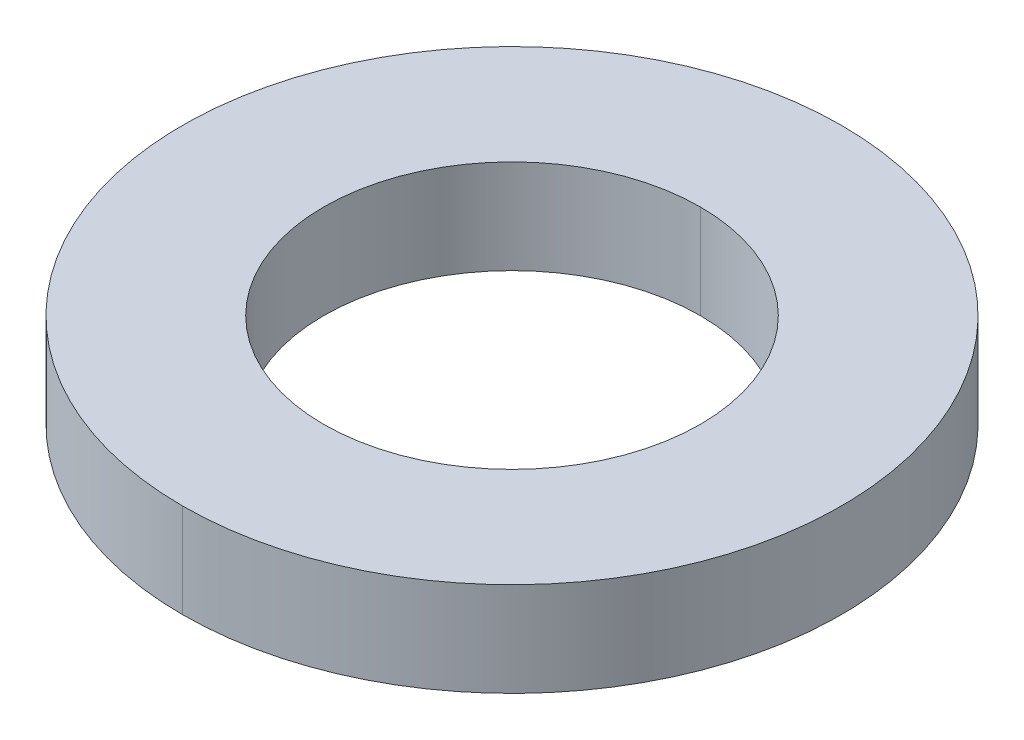
ISO-10303-21;
HEADER;
FILE_DESCRIPTION(('STEP AP214'),'2;1');
FILE_NAME('part.step','',(''),(''),'','','');
FILE_SCHEMA(('AUTOMOTIVE_DESIGN { 1 0 10303 214 1 1 1 1 }'));
ENDSEC;
DATA;
#1=APPLICATION_CONTEXT('core data for automotive mechanical design processes');
#2=APPLICATION_PROTOCOL_DEFINITION('international standard','automotive_design',2000,#1);
#3=PRODUCT_CONTEXT('',#1,'mechanical');
#4=PRODUCT('Part','Part','',(#3));
#5=PRODUCT_RELATED_PRODUCT_CATEGORY('part','',(#4));
#6=PRODUCT_DEFINITION_FORMATION('','',#4);
#7=PRODUCT_DEFINITION_CONTEXT('part definition',#1,'design');
#8=PRODUCT_DEFINITION('design','',#6,#7);
#9=PRODUCT_DEFINITION_SHAPE('','',#8);
#10=(LENGTH_UNIT() NAMED_UNIT(*) SI_UNIT(.MILLI.,.METRE.));
#11=(NAMED_UNIT(*) PLANE_ANGLE_UNIT() SI_UNIT($,.RADIAN.));
#12=(NAMED_UNIT(*) SI_UNIT($,.STERADIAN.) SOLID_ANGLE_UNIT());
#13=UNCERTAINTY_MEASURE_WITH_UNIT(LENGTH_MEASURE(1.E-05),#10,'distance_accuracy_value','');
#14=(GEOMETRIC_REPRESENTATION_CONTEXT(3) GLOBAL_UNCERTAINTY_ASSIGNED_CONTEXT((#13)) GLOBAL_UNIT_ASSIGNED_CONTEXT((#10,
#11,#12)) REPRESENTATION_CONTEXT('',''));
#15=CARTESIAN_POINT('',(0.,0.,0.));
#16=DIRECTION('',(0.,0.,1.));
#17=DIRECTION('',(1.,0.,0.));
#18=AXIS2_PLACEMENT_3D('',#15,#16,#17);
#19=CARTESIAN_POINT('',(0.,1.,0.));
#20=DIRECTION('',(0.,-1.,0.));
#21=DIRECTION('',(0.,0.,-1.));
#22=AXIS2_PLACEMENT_3D('',#19,#20,#21);
#23=CYLINDRICAL_SURFACE('',#22,2.);
#24=DIRECTION('',(0.,-1.,0.));
#25=VECTOR('',#24,1.);
#26=CARTESIAN_POINT('',(0.,1.,2.));
#27=LINE('',#26,#25);
#28=CARTESIAN_POINT('',(0.,1.,2.));
#29=VERTEX_POINT('',#28);
#30=CARTESIAN_POINT('',(0.,0.,2.));
#31=VERTEX_POINT('',#30);
#32=EDGE_CURVE('E76',#29,#31,#27,.T.);
#33=ORIENTED_EDGE('',*,*,#32,.F.);
#34=CARTESIAN_POINT('',(0.,1.,0.));
#35=DIRECTION('',(0.,1.,0.));
#36=DIRECTION('',(0.,0.,1.));
#37=AXIS2_PLACEMENT_3D('',#34,#35,#36);
#38=CIRCLE('',#37,2.);
#39=CARTESIAN_POINT('',(0.,1.,-2.));
#40=VERTEX_POINT('',#39);
#41=EDGE_CURVE('E19',#29,#40,#38,.T.);
#42=ORIENTED_EDGE('',*,*,#41,.T.);
#43=DIRECTION('',(0.,-1.,0.));
#44=VECTOR('',#43,1.);
#45=CARTESIAN_POINT('',(0.,1.,-2.));
#46=LINE('',#45,#44);
#47=CARTESIAN_POINT('',(0.,0.,-2.));
#48=VERTEX_POINT('',#47);
#49=EDGE_CURVE('E73',#40,#48,#46,.T.);
#50=ORIENTED_EDGE('',*,*,#49,.T.);
#51=CARTESIAN_POINT('',(0.,0.,0.));
#52=DIRECTION('',(0.,1.,0.));
#53=DIRECTION('',(0.,0.,1.));
#54=AXIS2_PLACEMENT_3D('',#51,#52,#53);
#55=CIRCLE('',#54,2.);
#56=EDGE_CURVE('E10',#31,#48,#55,.T.);
#57=ORIENTED_EDGE('',*,*,#56,.F.);
#58=EDGE_LOOP('',(#33,#42,#50,#57));
#59=FACE_BOUND('',#58,.T.);
#60=ADVANCED_FACE('F16',(#59),#23,.F.);
#61=CARTESIAN_POINT('',(0.,1.,0.));
#62=DIRECTION('',(0.,-1.,0.));
#63=DIRECTION('',(0.,0.,-1.));
#64=AXIS2_PLACEMENT_3D('',#61,#62,#63);
#65=CYLINDRICAL_SURFACE('',#64,3.5);
#66=DIRECTION('',(0.,-1.,0.));
#67=VECTOR('',#66,1.);
#68=CARTESIAN_POINT('',(0.,1.,3.5));
#69=LINE('',#68,#67);
#70=CARTESIAN_POINT('',(0.,1.,3.5));
#71=VERTEX_POINT('',#70);
#72=CARTESIAN_POINT('',(0.,0.,3.5));
#73=VERTEX_POINT('',#72);
#74=EDGE_CURVE('E106',#71,#73,#69,.T.);
#75=ORIENTED_EDGE('',*,*,#74,.F.);
#76=CARTESIAN_POINT('',(0.,1.,0.));
#77=DIRECTION('',(0.,1.,0.));
#78=DIRECTION('',(0.,0.,1.));
#79=AXIS2_PLACEMENT_3D('',#76,#77,#78);
#80=CIRCLE('',#79,3.5);
#81=CARTESIAN_POINT('',(0.,1.,-3.5));
#82=VERTEX_POINT('',#81);
#83=EDGE_CURVE('E81',#82,#71,#80,.T.);
#84=ORIENTED_EDGE('',*,*,#83,.F.);
#85=DIRECTION('',(0.,-1.,0.));
#86=VECTOR('',#85,1.);
#87=CARTESIAN_POINT('',(0.,1.,-3.5));
#88=LINE('',#87,#86);
#89=CARTESIAN_POINT('',(0.,0.,-3.5));
#90=VERTEX_POINT('',#89);
#91=EDGE_CURVE('E113',#82,#90,#88,.T.);
#92=ORIENTED_EDGE('',*,*,#91,.T.);
#93=CARTESIAN_POINT('',(0.,0.,0.));
#94=DIRECTION('',(0.,1.,0.));
#95=DIRECTION('',(0.,0.,1.));
#96=AXIS2_PLACEMENT_3D('',#93,#94,#95);
#97=CIRCLE('',#96,3.5);
#98=EDGE_CURVE('E25',#90,#73,#97,.T.);
#99=ORIENTED_EDGE('',*,*,#98,.T.);
#100=EDGE_LOOP('',(#75,#84,#92,#99));
#101=FACE_BOUND('',#100,.T.);
#102=ADVANCED_FACE('F120',(#101),#65,.T.);
#103=CARTESIAN_POINT('',(0.,0.,0.));
#104=DIRECTION('',(0.,1.,0.));
#105=DIRECTION('',(1.,0.,0.));
#106=AXIS2_PLACEMENT_3D('',#103,#104,#105);
#107=PLANE('',#106);
#108=CARTESIAN_POINT('',(0.,0.,0.));
#109=DIRECTION('',(0.,1.,0.));
#110=DIRECTION('',(0.,0.,1.));
#111=AXIS2_PLACEMENT_3D('',#108,#109,#110);
#112=CIRCLE('',#111,2.);
#113=EDGE_CURVE('E86',#48,#31,#112,.T.);
#114=ORIENTED_EDGE('',*,*,#113,.T.);
#115=ORIENTED_EDGE('',*,*,#56,.T.);
#116=EDGE_LOOP('',(#114,#115));
#117=FACE_BOUND('',#116,.T.);
#118=ORIENTED_EDGE('',*,*,#98,.F.);
#119=CARTESIAN_POINT('',(0.,0.,0.));
#120=DIRECTION('',(0.,1.,0.));
#121=DIRECTION('',(0.,0.,1.));
#122=AXIS2_PLACEMENT_3D('',#119,#120,#121);
#123=CIRCLE('',#122,3.5);
#124=EDGE_CURVE('E100',#73,#90,#123,.T.);
#125=ORIENTED_EDGE('',*,*,#124,.F.);
#126=EDGE_LOOP('',(#118,#125));
#127=FACE_BOUND('',#126,.T.);
#128=ADVANCED_FACE('F166',(#117,#127),#107,.F.);
#129=CARTESIAN_POINT('',(0.,1.,0.));
#130=DIRECTION('',(0.,1.,0.));
#131=DIRECTION('',(1.,0.,0.));
#132=AXIS2_PLACEMENT_3D('',#129,#130,#131);
#133=PLANE('',#132);
#134=CARTESIAN_POINT('',(0.,1.,0.));
#135=DIRECTION('',(0.,1.,0.));
#136=DIRECTION('',(0.,0.,1.));
#137=AXIS2_PLACEMENT_3D('',#134,#135,#136);
#138=CIRCLE('',#137,2.);
#139=EDGE_CURVE('E84',#40,#29,#138,.T.);
#140=ORIENTED_EDGE('',*,*,#139,.F.);
#141=ORIENTED_EDGE('',*,*,#41,.F.);
#142=EDGE_LOOP('',(#140,#141));
#143=FACE_BOUND('',#142,.T.);
#144=ORIENTED_EDGE('',*,*,#83,.T.);
#145=CARTESIAN_POINT('',(0.,1.,0.));
#146=DIRECTION('',(0.,1.,0.));
#147=DIRECTION('',(0.,0.,1.));
#148=AXIS2_PLACEMENT_3D('',#145,#146,#147);
#149=CIRCLE('',#148,3.5);
#150=EDGE_CURVE('E88',#71,#82,#149,.T.);
#151=ORIENTED_EDGE('',*,*,#150,.T.);
#152=EDGE_LOOP('',(#144,#151));
#153=FACE_BOUND('',#152,.T.);
#154=ADVANCED_FACE('F90',(#143,#153),#133,.T.);
#155=CARTESIAN_POINT('',(0.,1.,0.));
#156=DIRECTION('',(0.,-1.,0.));
#157=DIRECTION('',(0.,0.,-1.));
#158=AXIS2_PLACEMENT_3D('',#155,#156,#157);
#159=CYLINDRICAL_SURFACE('',#158,3.5);
#160=ORIENTED_EDGE('',*,*,#150,.F.);
#161=ORIENTED_EDGE('',*,*,#74,.T.);
#162=ORIENTED_EDGE('',*,*,#124,.T.);
#163=ORIENTED_EDGE('',*,*,#91,.F.);
#164=EDGE_LOOP('',(#160,#161,#162,#163));
#165=FACE_BOUND('',#164,.T.);
#166=ADVANCED_FACE('F123',(#165),#159,.T.);
#167=CARTESIAN_POINT('',(0.,1.,0.));
#168=DIRECTION('',(0.,-1.,0.));
#169=DIRECTION('',(0.,0.,-1.));
#170=AXIS2_PLACEMENT_3D('',#167,#168,#169);
#171=CYLINDRICAL_SURFACE('',#170,2.);
#172=ORIENTED_EDGE('',*,*,#139,.T.);
#173=ORIENTED_EDGE('',*,*,#32,.T.);
#174=ORIENTED_EDGE('',*,*,#113,.F.);
#175=ORIENTED_EDGE('',*,*,#49,.F.);
#176=EDGE_LOOP('',(#172,#173,#174,#175));
#177=FACE_BOUND('',#176,.T.);
#178=ADVANCED_FACE('F83',(#177),#171,.F.);
#179=CLOSED_SHELL('',(#60,#102,#128,#154,#166,#178));
#180=MANIFOLD_SOLID_BREP('B1',#179);
#181=ADVANCED_BREP_SHAPE_REPRESENTATION('',(#18,#180),#14);
#182=SHAPE_DEFINITION_REPRESENTATION(#9,#181);
ENDSEC;
END-ISO-10303-21;
